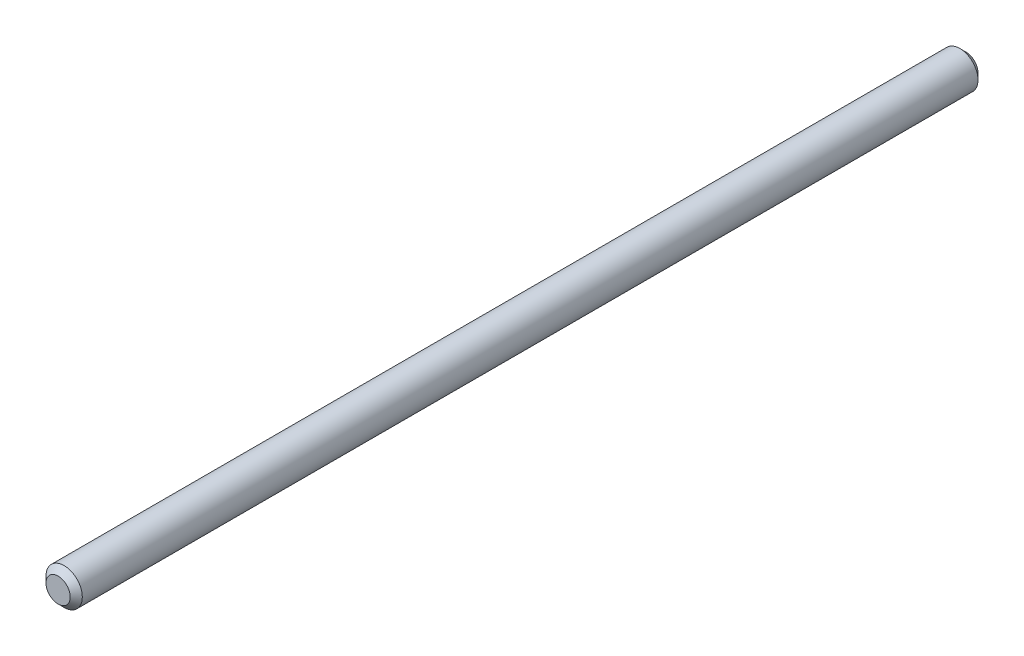
ISO-10303-21;
HEADER;
FILE_DESCRIPTION(('STEP AP214'),'2;1');
FILE_NAME('part.step','',(''),(''),'','','');
FILE_SCHEMA(('AUTOMOTIVE_DESIGN { 1 0 10303 214 1 1 1 1 }'));
ENDSEC;
DATA;
#1=APPLICATION_CONTEXT('core data for automotive mechanical design processes');
#2=APPLICATION_PROTOCOL_DEFINITION('international standard','automotive_design',2000,#1);
#3=PRODUCT_CONTEXT('',#1,'mechanical');
#4=PRODUCT('Part','Part','',(#3));
#5=PRODUCT_RELATED_PRODUCT_CATEGORY('part','',(#4));
#6=PRODUCT_DEFINITION_FORMATION('','',#4);
#7=PRODUCT_DEFINITION_CONTEXT('part definition',#1,'design');
#8=PRODUCT_DEFINITION('design','',#6,#7);
#9=PRODUCT_DEFINITION_SHAPE('','',#8);
#10=(LENGTH_UNIT() NAMED_UNIT(*) SI_UNIT(.MILLI.,.METRE.));
#11=(NAMED_UNIT(*) PLANE_ANGLE_UNIT() SI_UNIT($,.RADIAN.));
#12=(NAMED_UNIT(*) SI_UNIT($,.STERADIAN.) SOLID_ANGLE_UNIT());
#13=UNCERTAINTY_MEASURE_WITH_UNIT(LENGTH_MEASURE(1.E-05),#10,'distance_accuracy_value','');
#14=(GEOMETRIC_REPRESENTATION_CONTEXT(3) GLOBAL_UNCERTAINTY_ASSIGNED_CONTEXT((#13)) GLOBAL_UNIT_ASSIGNED_CONTEXT((#10,
#11,#12)) REPRESENTATION_CONTEXT('',''));
#15=CARTESIAN_POINT('',(0.,0.,0.));
#16=DIRECTION('',(0.,0.,1.));
#17=DIRECTION('',(1.,0.,0.));
#18=AXIS2_PLACEMENT_3D('',#15,#16,#17);
#19=CARTESIAN_POINT('',(0.,0.,150.));
#20=DIRECTION('',(0.,0.,-1.));
#21=DIRECTION('',(-1.,0.,0.));
#22=AXIS2_PLACEMENT_3D('',#19,#20,#21);
#23=CYLINDRICAL_SURFACE('',#22,3.);
#24=CARTESIAN_POINT('',(0.,0.,1.));
#25=DIRECTION('',(0.,0.,1.));
#26=DIRECTION('',(1.,0.,0.));
#27=AXIS2_PLACEMENT_3D('',#24,#25,#26);
#28=CIRCLE('',#27,3.);
#29=CARTESIAN_POINT('',(3.,0.,1.));
#30=VERTEX_POINT('',#29);
#31=EDGE_CURVE('E50',#30,#30,#28,.T.);
#32=ORIENTED_EDGE('',*,*,#31,.T.);
#33=EDGE_LOOP('',(#32));
#34=FACE_BOUND('',#33,.T.);
#35=CARTESIAN_POINT('',(0.,0.,149.));
#36=DIRECTION('',(0.,0.,1.));
#37=DIRECTION('',(1.,0.,0.));
#38=AXIS2_PLACEMENT_3D('',#35,#36,#37);
#39=CIRCLE('',#38,3.);
#40=CARTESIAN_POINT('',(3.,0.,149.));
#41=VERTEX_POINT('',#40);
#42=EDGE_CURVE('E55',#41,#41,#39,.F.);
#43=ORIENTED_EDGE('',*,*,#42,.T.);
#44=EDGE_LOOP('',(#43));
#45=FACE_BOUND('',#44,.T.);
#46=ADVANCED_FACE('F37',(#34,#45),#23,.T.);
#47=CARTESIAN_POINT('',(0.,0.,150.));
#48=DIRECTION('',(0.,0.,1.));
#49=DIRECTION('',(1.,0.,0.));
#50=AXIS2_PLACEMENT_3D('',#47,#48,#49);
#51=PLANE('',#50);
#52=CARTESIAN_POINT('',(0.,0.,150.));
#53=DIRECTION('',(0.,0.,1.));
#54=DIRECTION('',(1.,0.,0.));
#55=AXIS2_PLACEMENT_3D('',#52,#53,#54);
#56=CIRCLE('',#55,2.00000000000003);
#57=CARTESIAN_POINT('',(2.00000000000003,0.,150.));
#58=VERTEX_POINT('',#57);
#59=EDGE_CURVE('E10',#58,#58,#56,.T.);
#60=ORIENTED_EDGE('',*,*,#59,.T.);
#61=EDGE_LOOP('',(#60));
#62=FACE_BOUND('',#61,.T.);
#63=ADVANCED_FACE('F72',(#62),#51,.T.);
#64=CARTESIAN_POINT('',(0.,0.,0.));
#65=DIRECTION('',(0.,0.,1.));
#66=DIRECTION('',(1.,0.,0.));
#67=AXIS2_PLACEMENT_3D('',#64,#65,#66);
#68=PLANE('',#67);
#69=CARTESIAN_POINT('',(0.,0.,0.));
#70=DIRECTION('',(0.,0.,1.));
#71=DIRECTION('',(1.,0.,0.));
#72=AXIS2_PLACEMENT_3D('',#69,#70,#71);
#73=CIRCLE('',#72,2.);
#74=CARTESIAN_POINT('',(2.,0.,0.));
#75=VERTEX_POINT('',#74);
#76=EDGE_CURVE('E45',#75,#75,#73,.F.);
#77=ORIENTED_EDGE('',*,*,#76,.T.);
#78=EDGE_LOOP('',(#77));
#79=FACE_BOUND('',#78,.T.);
#80=ADVANCED_FACE('F69',(#79),#68,.F.);
#81=CARTESIAN_POINT('',(0.,0.,1.));
#82=DIRECTION('',(0.,0.,1.));
#83=DIRECTION('',(1.,0.,0.));
#84=AXIS2_PLACEMENT_3D('',#81,#82,#83);
#85=CONICAL_SURFACE('',#84,3.,0.785398163397447);
#86=ORIENTED_EDGE('',*,*,#76,.F.);
#87=EDGE_LOOP('',(#86));
#88=FACE_BOUND('',#87,.T.);
#89=ORIENTED_EDGE('',*,*,#31,.F.);
#90=EDGE_LOOP('',(#89));
#91=FACE_BOUND('',#90,.T.);
#92=ADVANCED_FACE('F65',(#88,#91),#85,.T.);
#93=CARTESIAN_POINT('',(0.,0.,150.));
#94=DIRECTION('',(0.,0.,-1.));
#95=DIRECTION('',(-1.,0.,0.));
#96=AXIS2_PLACEMENT_3D('',#93,#94,#95);
#97=CONICAL_SURFACE('',#96,2.00000000000003,0.785398163397447);
#98=ORIENTED_EDGE('',*,*,#42,.F.);
#99=EDGE_LOOP('',(#98));
#100=FACE_BOUND('',#99,.T.);
#101=ORIENTED_EDGE('',*,*,#59,.F.);
#102=EDGE_LOOP('',(#101));
#103=FACE_BOUND('',#102,.T.);
#104=ADVANCED_FACE('F39',(#100,#103),#97,.T.);
#105=CLOSED_SHELL('',(#46,#63,#80,#92,#104));
#106=MANIFOLD_SOLID_BREP('B2',#105);
#107=ADVANCED_BREP_SHAPE_REPRESENTATION('',(#18,#106),#14);
#108=SHAPE_DEFINITION_REPRESENTATION(#9,#107);
ENDSEC;
END-ISO-10303-21;
